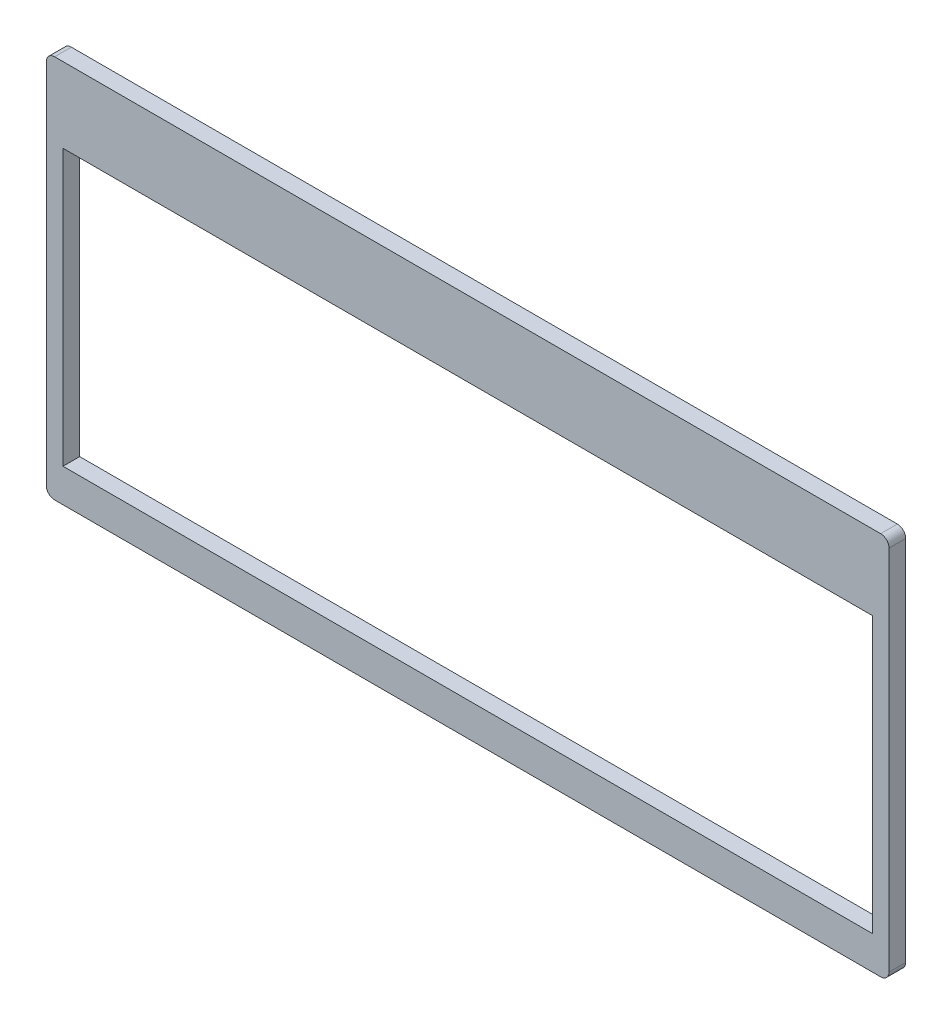
ISO-10303-21;
HEADER;
FILE_DESCRIPTION(('STEP AP214'),'2;1');
FILE_NAME('part.step','',(''),(''),'','','');
FILE_SCHEMA(('AUTOMOTIVE_DESIGN { 1 0 10303 214 1 1 1 1 }'));
ENDSEC;
DATA;
#1=APPLICATION_CONTEXT('core data for automotive mechanical design processes');
#2=APPLICATION_PROTOCOL_DEFINITION('international standard','automotive_design',2000,#1);
#3=PRODUCT_CONTEXT('',#1,'mechanical');
#4=PRODUCT('Part','Part','',(#3));
#5=PRODUCT_RELATED_PRODUCT_CATEGORY('part','',(#4));
#6=PRODUCT_DEFINITION_FORMATION('','',#4);
#7=PRODUCT_DEFINITION_CONTEXT('part definition',#1,'design');
#8=PRODUCT_DEFINITION('design','',#6,#7);
#9=PRODUCT_DEFINITION_SHAPE('','',#8);
#10=(LENGTH_UNIT() NAMED_UNIT(*) SI_UNIT(.MILLI.,.METRE.));
#11=(NAMED_UNIT(*) PLANE_ANGLE_UNIT() SI_UNIT($,.RADIAN.));
#12=(NAMED_UNIT(*) SI_UNIT($,.STERADIAN.) SOLID_ANGLE_UNIT());
#13=UNCERTAINTY_MEASURE_WITH_UNIT(LENGTH_MEASURE(1.E-05),#10,'distance_accuracy_value','');
#14=(GEOMETRIC_REPRESENTATION_CONTEXT(3) GLOBAL_UNCERTAINTY_ASSIGNED_CONTEXT((#13)) GLOBAL_UNIT_ASSIGNED_CONTEXT((#10,
#11,#12)) REPRESENTATION_CONTEXT('',''));
#15=CARTESIAN_POINT('',(0.,0.,0.));
#16=DIRECTION('',(0.,0.,1.));
#17=DIRECTION('',(1.,0.,0.));
#18=AXIS2_PLACEMENT_3D('',#15,#16,#17);
#19=CARTESIAN_POINT('',(0.,0.,2.));
#20=DIRECTION('',(0.,0.,1.));
#21=DIRECTION('',(1.,0.,0.));
#22=AXIS2_PLACEMENT_3D('',#19,#20,#21);
#23=PLANE('',#22);
#24=DIRECTION('',(1.,0.,0.));
#25=VECTOR('',#24,1.);
#26=CARTESIAN_POINT('',(-50.5,-23.,2.));
#27=LINE('',#26,#25);
#28=CARTESIAN_POINT('',(-49.5,-23.,2.));
#29=VERTEX_POINT('',#28);
#30=CARTESIAN_POINT('',(49.5,-23.,2.));
#31=VERTEX_POINT('',#30);
#32=EDGE_CURVE('E173',#29,#31,#27,.T.);
#33=ORIENTED_EDGE('',*,*,#32,.T.);
#34=CARTESIAN_POINT('',(49.5,-22.,2.));
#35=DIRECTION('',(0.,0.,1.));
#36=DIRECTION('',(1.,0.,0.));
#37=AXIS2_PLACEMENT_3D('',#34,#35,#36);
#38=CIRCLE('',#37,1.);
#39=CARTESIAN_POINT('',(50.5,-22.,2.));
#40=VERTEX_POINT('',#39);
#41=EDGE_CURVE('E214',#31,#40,#38,.T.);
#42=ORIENTED_EDGE('',*,*,#41,.T.);
#43=DIRECTION('',(0.,1.,0.));
#44=VECTOR('',#43,1.);
#45=CARTESIAN_POINT('',(50.5,23.,2.));
#46=LINE('',#45,#44);
#47=CARTESIAN_POINT('',(50.5,22.,2.));
#48=VERTEX_POINT('',#47);
#49=EDGE_CURVE('E166',#40,#48,#46,.T.);
#50=ORIENTED_EDGE('',*,*,#49,.T.);
#51=CARTESIAN_POINT('',(49.5,22.,2.));
#52=DIRECTION('',(0.,0.,1.));
#53=DIRECTION('',(1.,0.,0.));
#54=AXIS2_PLACEMENT_3D('',#51,#52,#53);
#55=CIRCLE('',#54,1.);
#56=CARTESIAN_POINT('',(49.5,23.,2.));
#57=VERTEX_POINT('',#56);
#58=EDGE_CURVE('E55',#48,#57,#55,.T.);
#59=ORIENTED_EDGE('',*,*,#58,.T.);
#60=DIRECTION('',(-1.,0.,0.));
#61=VECTOR('',#60,1.);
#62=CARTESIAN_POINT('',(-50.5,23.,2.));
#63=LINE('',#62,#61);
#64=CARTESIAN_POINT('',(-49.5,23.,2.));
#65=VERTEX_POINT('',#64);
#66=EDGE_CURVE('E168',#57,#65,#63,.T.);
#67=ORIENTED_EDGE('',*,*,#66,.T.);
#68=CARTESIAN_POINT('',(-49.5,22.,2.));
#69=DIRECTION('',(0.,0.,1.));
#70=DIRECTION('',(1.,0.,0.));
#71=AXIS2_PLACEMENT_3D('',#68,#69,#70);
#72=CIRCLE('',#71,1.);
#73=CARTESIAN_POINT('',(-50.5,22.,2.));
#74=VERTEX_POINT('',#73);
#75=EDGE_CURVE('E193',#65,#74,#72,.T.);
#76=ORIENTED_EDGE('',*,*,#75,.T.);
#77=DIRECTION('',(0.,-1.,0.));
#78=VECTOR('',#77,1.);
#79=CARTESIAN_POINT('',(-50.5,23.,2.));
#80=LINE('',#79,#78);
#81=CARTESIAN_POINT('',(-50.5,-22.,2.));
#82=VERTEX_POINT('',#81);
#83=EDGE_CURVE('E171',#74,#82,#80,.T.);
#84=ORIENTED_EDGE('',*,*,#83,.T.);
#85=CARTESIAN_POINT('',(-49.5,-22.,2.));
#86=DIRECTION('',(0.,0.,1.));
#87=DIRECTION('',(1.,0.,0.));
#88=AXIS2_PLACEMENT_3D('',#85,#86,#87);
#89=CIRCLE('',#88,1.);
#90=EDGE_CURVE('E211',#82,#29,#89,.T.);
#91=ORIENTED_EDGE('',*,*,#90,.T.);
#92=EDGE_LOOP('',(#33,#42,#50,#59,#67,#76,#84,#91));
#93=FACE_BOUND('',#92,.T.);
#94=DIRECTION('',(-1.,0.,0.));
#95=VECTOR('',#94,1.);
#96=CARTESIAN_POINT('',(-48.5,14.,2.));
#97=LINE('',#96,#95);
#98=CARTESIAN_POINT('',(48.5,14.,2.));
#99=VERTEX_POINT('',#98);
#100=CARTESIAN_POINT('',(-48.5,14.,2.));
#101=VERTEX_POINT('',#100);
#102=EDGE_CURVE('E135',#99,#101,#97,.T.);
#103=ORIENTED_EDGE('',*,*,#102,.F.);
#104=DIRECTION('',(0.,1.,0.));
#105=VECTOR('',#104,1.);
#106=CARTESIAN_POINT('',(48.5,14.,2.));
#107=LINE('',#106,#105);
#108=CARTESIAN_POINT('',(48.5,-19.,2.));
#109=VERTEX_POINT('',#108);
#110=EDGE_CURVE('E125',#109,#99,#107,.T.);
#111=ORIENTED_EDGE('',*,*,#110,.F.);
#112=DIRECTION('',(1.,0.,0.));
#113=VECTOR('',#112,1.);
#114=CARTESIAN_POINT('',(-48.5,-19.,2.));
#115=LINE('',#114,#113);
#116=CARTESIAN_POINT('',(-48.5,-19.,2.));
#117=VERTEX_POINT('',#116);
#118=EDGE_CURVE('E150',#117,#109,#115,.T.);
#119=ORIENTED_EDGE('',*,*,#118,.F.);
#120=DIRECTION('',(0.,-1.,0.));
#121=VECTOR('',#120,1.);
#122=CARTESIAN_POINT('',(-48.5,14.,2.));
#123=LINE('',#122,#121);
#124=EDGE_CURVE('E148',#101,#117,#123,.T.);
#125=ORIENTED_EDGE('',*,*,#124,.F.);
#126=EDGE_LOOP('',(#103,#111,#119,#125));
#127=FACE_BOUND('',#126,.T.);
#128=ADVANCED_FACE('F34',(#93,#127),#23,.T.);
#129=CARTESIAN_POINT('',(0.,0.,0.));
#130=DIRECTION('',(0.,0.,1.));
#131=DIRECTION('',(1.,0.,0.));
#132=AXIS2_PLACEMENT_3D('',#129,#130,#131);
#133=PLANE('',#132);
#134=DIRECTION('',(0.,1.,0.));
#135=VECTOR('',#134,1.);
#136=CARTESIAN_POINT('',(50.5,23.,0.));
#137=LINE('',#136,#135);
#138=CARTESIAN_POINT('',(50.5,-22.,0.));
#139=VERTEX_POINT('',#138);
#140=CARTESIAN_POINT('',(50.5,22.,0.));
#141=VERTEX_POINT('',#140);
#142=EDGE_CURVE('E143',#139,#141,#137,.T.);
#143=ORIENTED_EDGE('',*,*,#142,.F.);
#144=CARTESIAN_POINT('',(49.5,-22.,0.));
#145=DIRECTION('',(0.,0.,1.));
#146=DIRECTION('',(1.,0.,0.));
#147=AXIS2_PLACEMENT_3D('',#144,#145,#146);
#148=CIRCLE('',#147,1.);
#149=CARTESIAN_POINT('',(49.5,-23.,0.));
#150=VERTEX_POINT('',#149);
#151=EDGE_CURVE('E204',#139,#150,#148,.F.);
#152=ORIENTED_EDGE('',*,*,#151,.T.);
#153=DIRECTION('',(1.,0.,0.));
#154=VECTOR('',#153,1.);
#155=CARTESIAN_POINT('',(-50.5,-23.,0.));
#156=LINE('',#155,#154);
#157=CARTESIAN_POINT('',(-49.5,-23.,0.));
#158=VERTEX_POINT('',#157);
#159=EDGE_CURVE('E169',#158,#150,#156,.T.);
#160=ORIENTED_EDGE('',*,*,#159,.F.);
#161=CARTESIAN_POINT('',(-49.5,-22.,0.));
#162=DIRECTION('',(0.,0.,1.));
#163=DIRECTION('',(1.,0.,0.));
#164=AXIS2_PLACEMENT_3D('',#161,#162,#163);
#165=CIRCLE('',#164,1.);
#166=CARTESIAN_POINT('',(-50.5,-22.,0.));
#167=VERTEX_POINT('',#166);
#168=EDGE_CURVE('E200',#158,#167,#165,.F.);
#169=ORIENTED_EDGE('',*,*,#168,.T.);
#170=DIRECTION('',(0.,-1.,0.));
#171=VECTOR('',#170,1.);
#172=CARTESIAN_POINT('',(-50.5,23.,0.));
#173=LINE('',#172,#171);
#174=CARTESIAN_POINT('',(-50.5,22.,0.));
#175=VERTEX_POINT('',#174);
#176=EDGE_CURVE('E181',#175,#167,#173,.T.);
#177=ORIENTED_EDGE('',*,*,#176,.F.);
#178=CARTESIAN_POINT('',(-49.5,22.,0.));
#179=DIRECTION('',(0.,0.,1.));
#180=DIRECTION('',(1.,0.,0.));
#181=AXIS2_PLACEMENT_3D('',#178,#179,#180);
#182=CIRCLE('',#181,1.);
#183=CARTESIAN_POINT('',(-49.5,23.,0.));
#184=VERTEX_POINT('',#183);
#185=EDGE_CURVE('E187',#175,#184,#182,.F.);
#186=ORIENTED_EDGE('',*,*,#185,.T.);
#187=DIRECTION('',(-1.,0.,0.));
#188=VECTOR('',#187,1.);
#189=CARTESIAN_POINT('',(-50.5,23.,0.));
#190=LINE('',#189,#188);
#191=CARTESIAN_POINT('',(49.5,23.,0.));
#192=VERTEX_POINT('',#191);
#193=EDGE_CURVE('E179',#192,#184,#190,.T.);
#194=ORIENTED_EDGE('',*,*,#193,.F.);
#195=CARTESIAN_POINT('',(49.5,22.,0.));
#196=DIRECTION('',(0.,0.,1.));
#197=DIRECTION('',(1.,0.,0.));
#198=AXIS2_PLACEMENT_3D('',#195,#196,#197);
#199=CIRCLE('',#198,1.);
#200=EDGE_CURVE('E202',#192,#141,#199,.F.);
#201=ORIENTED_EDGE('',*,*,#200,.T.);
#202=EDGE_LOOP('',(#143,#152,#160,#169,#177,#186,#194,#201));
#203=FACE_BOUND('',#202,.T.);
#204=DIRECTION('',(0.,1.,0.));
#205=VECTOR('',#204,1.);
#206=CARTESIAN_POINT('',(48.5,14.,0.));
#207=LINE('',#206,#205);
#208=CARTESIAN_POINT('',(48.5,-19.,0.));
#209=VERTEX_POINT('',#208);
#210=CARTESIAN_POINT('',(48.5,14.,0.));
#211=VERTEX_POINT('',#210);
#212=EDGE_CURVE('E154',#209,#211,#207,.T.);
#213=ORIENTED_EDGE('',*,*,#212,.T.);
#214=DIRECTION('',(-1.,0.,0.));
#215=VECTOR('',#214,1.);
#216=CARTESIAN_POINT('',(-48.5,14.,0.));
#217=LINE('',#216,#215);
#218=CARTESIAN_POINT('',(-48.5,14.,0.));
#219=VERTEX_POINT('',#218);
#220=EDGE_CURVE('E142',#211,#219,#217,.T.);
#221=ORIENTED_EDGE('',*,*,#220,.T.);
#222=DIRECTION('',(0.,-1.,0.));
#223=VECTOR('',#222,1.);
#224=CARTESIAN_POINT('',(-48.5,14.,0.));
#225=LINE('',#224,#223);
#226=CARTESIAN_POINT('',(-48.5,-19.,0.));
#227=VERTEX_POINT('',#226);
#228=EDGE_CURVE('E157',#219,#227,#225,.T.);
#229=ORIENTED_EDGE('',*,*,#228,.T.);
#230=DIRECTION('',(1.,0.,0.));
#231=VECTOR('',#230,1.);
#232=CARTESIAN_POINT('',(-48.5,-19.,0.));
#233=LINE('',#232,#231);
#234=EDGE_CURVE('E136',#227,#209,#233,.T.);
#235=ORIENTED_EDGE('',*,*,#234,.T.);
#236=EDGE_LOOP('',(#213,#221,#229,#235));
#237=FACE_BOUND('',#236,.T.);
#238=ADVANCED_FACE('F223',(#203,#237),#133,.F.);
#239=CARTESIAN_POINT('',(50.5,23.,2.));
#240=DIRECTION('',(-1.,0.,0.));
#241=DIRECTION('',(0.,-1.,0.));
#242=AXIS2_PLACEMENT_3D('',#239,#240,#241);
#243=PLANE('',#242);
#244=ORIENTED_EDGE('',*,*,#49,.F.);
#245=DIRECTION('',(0.,0.,-1.));
#246=VECTOR('',#245,1.);
#247=CARTESIAN_POINT('',(50.5,-22.,2.));
#248=LINE('',#247,#246);
#249=EDGE_CURVE('E197',#40,#139,#248,.T.);
#250=ORIENTED_EDGE('',*,*,#249,.T.);
#251=ORIENTED_EDGE('',*,*,#142,.T.);
#252=DIRECTION('',(0.,0.,-1.));
#253=VECTOR('',#252,1.);
#254=CARTESIAN_POINT('',(50.5,22.,2.));
#255=LINE('',#254,#253);
#256=EDGE_CURVE('E195',#141,#48,#255,.F.);
#257=ORIENTED_EDGE('',*,*,#256,.T.);
#258=EDGE_LOOP('',(#244,#250,#251,#257));
#259=FACE_BOUND('',#258,.T.);
#260=ADVANCED_FACE('F246',(#259),#243,.F.);
#261=CARTESIAN_POINT('',(-50.5,23.,2.));
#262=DIRECTION('',(0.,-1.,0.));
#263=DIRECTION('',(0.,0.,-1.));
#264=AXIS2_PLACEMENT_3D('',#261,#262,#263);
#265=PLANE('',#264);
#266=ORIENTED_EDGE('',*,*,#66,.F.);
#267=DIRECTION('',(0.,0.,-1.));
#268=VECTOR('',#267,1.);
#269=CARTESIAN_POINT('',(49.5,23.,2.));
#270=LINE('',#269,#268);
#271=EDGE_CURVE('E42',#57,#192,#270,.T.);
#272=ORIENTED_EDGE('',*,*,#271,.T.);
#273=ORIENTED_EDGE('',*,*,#193,.T.);
#274=DIRECTION('',(0.,0.,-1.));
#275=VECTOR('',#274,1.);
#276=CARTESIAN_POINT('',(-49.5,23.,2.));
#277=LINE('',#276,#275);
#278=EDGE_CURVE('E190',#184,#65,#277,.F.);
#279=ORIENTED_EDGE('',*,*,#278,.T.);
#280=EDGE_LOOP('',(#266,#272,#273,#279));
#281=FACE_BOUND('',#280,.T.);
#282=ADVANCED_FACE('F219',(#281),#265,.F.);
#283=CARTESIAN_POINT('',(-50.5,23.,2.));
#284=DIRECTION('',(1.,0.,0.));
#285=DIRECTION('',(0.,0.,-1.));
#286=AXIS2_PLACEMENT_3D('',#283,#284,#285);
#287=PLANE('',#286);
#288=ORIENTED_EDGE('',*,*,#176,.T.);
#289=DIRECTION('',(0.,0.,-1.));
#290=VECTOR('',#289,1.);
#291=CARTESIAN_POINT('',(-50.5,-22.,2.));
#292=LINE('',#291,#290);
#293=EDGE_CURVE('E11',#167,#82,#292,.F.);
#294=ORIENTED_EDGE('',*,*,#293,.T.);
#295=ORIENTED_EDGE('',*,*,#83,.F.);
#296=DIRECTION('',(0.,0.,-1.));
#297=VECTOR('',#296,1.);
#298=CARTESIAN_POINT('',(-50.5,22.,2.));
#299=LINE('',#298,#297);
#300=EDGE_CURVE('E176',#74,#175,#299,.T.);
#301=ORIENTED_EDGE('',*,*,#300,.T.);
#302=EDGE_LOOP('',(#288,#294,#295,#301));
#303=FACE_BOUND('',#302,.T.);
#304=ADVANCED_FACE('F232',(#303),#287,.F.);
#305=CARTESIAN_POINT('',(-50.5,-23.,2.));
#306=DIRECTION('',(0.,1.,0.));
#307=DIRECTION('',(0.,0.,1.));
#308=AXIS2_PLACEMENT_3D('',#305,#306,#307);
#309=PLANE('',#308);
#310=ORIENTED_EDGE('',*,*,#159,.T.);
#311=DIRECTION('',(0.,0.,-1.));
#312=VECTOR('',#311,1.);
#313=CARTESIAN_POINT('',(49.5,-23.,2.));
#314=LINE('',#313,#312);
#315=EDGE_CURVE('E209',#150,#31,#314,.F.);
#316=ORIENTED_EDGE('',*,*,#315,.T.);
#317=ORIENTED_EDGE('',*,*,#32,.F.);
#318=DIRECTION('',(0.,0.,-1.));
#319=VECTOR('',#318,1.);
#320=CARTESIAN_POINT('',(-49.5,-23.,2.));
#321=LINE('',#320,#319);
#322=EDGE_CURVE('E206',#29,#158,#321,.T.);
#323=ORIENTED_EDGE('',*,*,#322,.T.);
#324=EDGE_LOOP('',(#310,#316,#317,#323));
#325=FACE_BOUND('',#324,.T.);
#326=ADVANCED_FACE('F238',(#325),#309,.F.);
#327=CARTESIAN_POINT('',(48.5,14.,2.));
#328=DIRECTION('',(-1.,0.,0.));
#329=DIRECTION('',(0.,0.,1.));
#330=AXIS2_PLACEMENT_3D('',#327,#328,#329);
#331=PLANE('',#330);
#332=ORIENTED_EDGE('',*,*,#212,.F.);
#333=DIRECTION('',(0.,0.,-1.));
#334=VECTOR('',#333,1.);
#335=CARTESIAN_POINT('',(48.5,-19.,2.));
#336=LINE('',#335,#334);
#337=EDGE_CURVE('E131',#109,#209,#336,.T.);
#338=ORIENTED_EDGE('',*,*,#337,.F.);
#339=ORIENTED_EDGE('',*,*,#110,.T.);
#340=DIRECTION('',(0.,0.,-1.));
#341=VECTOR('',#340,1.);
#342=CARTESIAN_POINT('',(48.5,14.,2.));
#343=LINE('',#342,#341);
#344=EDGE_CURVE('E128',#99,#211,#343,.T.);
#345=ORIENTED_EDGE('',*,*,#344,.T.);
#346=EDGE_LOOP('',(#332,#338,#339,#345));
#347=FACE_BOUND('',#346,.T.);
#348=ADVANCED_FACE('F127',(#347),#331,.T.);
#349=CARTESIAN_POINT('',(-48.5,14.,2.));
#350=DIRECTION('',(0.,-1.,0.));
#351=DIRECTION('',(0.,0.,-1.));
#352=AXIS2_PLACEMENT_3D('',#349,#350,#351);
#353=PLANE('',#352);
#354=ORIENTED_EDGE('',*,*,#220,.F.);
#355=ORIENTED_EDGE('',*,*,#344,.F.);
#356=ORIENTED_EDGE('',*,*,#102,.T.);
#357=DIRECTION('',(0.,0.,-1.));
#358=VECTOR('',#357,1.);
#359=CARTESIAN_POINT('',(-48.5,14.,2.));
#360=LINE('',#359,#358);
#361=EDGE_CURVE('E144',#101,#219,#360,.T.);
#362=ORIENTED_EDGE('',*,*,#361,.T.);
#363=EDGE_LOOP('',(#354,#355,#356,#362));
#364=FACE_BOUND('',#363,.T.);
#365=ADVANCED_FACE('F139',(#364),#353,.T.);
#366=CARTESIAN_POINT('',(-48.5,14.,2.));
#367=DIRECTION('',(1.,0.,0.));
#368=DIRECTION('',(0.,1.,0.));
#369=AXIS2_PLACEMENT_3D('',#366,#367,#368);
#370=PLANE('',#369);
#371=ORIENTED_EDGE('',*,*,#228,.F.);
#372=ORIENTED_EDGE('',*,*,#361,.F.);
#373=ORIENTED_EDGE('',*,*,#124,.T.);
#374=DIRECTION('',(0.,0.,-1.));
#375=VECTOR('',#374,1.);
#376=CARTESIAN_POINT('',(-48.5,-19.,2.));
#377=LINE('',#376,#375);
#378=EDGE_CURVE('E163',#117,#227,#377,.T.);
#379=ORIENTED_EDGE('',*,*,#378,.T.);
#380=EDGE_LOOP('',(#371,#372,#373,#379));
#381=FACE_BOUND('',#380,.T.);
#382=ADVANCED_FACE('F277',(#381),#370,.T.);
#383=CARTESIAN_POINT('',(-48.5,-19.,2.));
#384=DIRECTION('',(0.,1.,0.));
#385=DIRECTION('',(0.,0.,1.));
#386=AXIS2_PLACEMENT_3D('',#383,#384,#385);
#387=PLANE('',#386);
#388=ORIENTED_EDGE('',*,*,#234,.F.);
#389=ORIENTED_EDGE('',*,*,#378,.F.);
#390=ORIENTED_EDGE('',*,*,#118,.T.);
#391=ORIENTED_EDGE('',*,*,#337,.T.);
#392=EDGE_LOOP('',(#388,#389,#390,#391));
#393=FACE_BOUND('',#392,.T.);
#394=ADVANCED_FACE('F273',(#393),#387,.T.);
#395=CARTESIAN_POINT('',(-49.5,22.,2.));
#396=DIRECTION('',(0.,0.,-1.));
#397=DIRECTION('',(-1.,0.,0.));
#398=AXIS2_PLACEMENT_3D('',#395,#396,#397);
#399=CYLINDRICAL_SURFACE('',#398,1.);
#400=ORIENTED_EDGE('',*,*,#75,.F.);
#401=ORIENTED_EDGE('',*,*,#278,.F.);
#402=ORIENTED_EDGE('',*,*,#185,.F.);
#403=ORIENTED_EDGE('',*,*,#300,.F.);
#404=EDGE_LOOP('',(#400,#401,#402,#403));
#405=FACE_BOUND('',#404,.T.);
#406=ADVANCED_FACE('F230',(#405),#399,.T.);
#407=CARTESIAN_POINT('',(49.5,-22.,2.));
#408=DIRECTION('',(0.,0.,-1.));
#409=DIRECTION('',(-1.,0.,0.));
#410=AXIS2_PLACEMENT_3D('',#407,#408,#409);
#411=CYLINDRICAL_SURFACE('',#410,1.);
#412=ORIENTED_EDGE('',*,*,#41,.F.);
#413=ORIENTED_EDGE('',*,*,#315,.F.);
#414=ORIENTED_EDGE('',*,*,#151,.F.);
#415=ORIENTED_EDGE('',*,*,#249,.F.);
#416=EDGE_LOOP('',(#412,#413,#414,#415));
#417=FACE_BOUND('',#416,.T.);
#418=ADVANCED_FACE('F242',(#417),#411,.T.);
#419=CARTESIAN_POINT('',(49.5,22.,2.));
#420=DIRECTION('',(0.,0.,-1.));
#421=DIRECTION('',(-1.,0.,0.));
#422=AXIS2_PLACEMENT_3D('',#419,#420,#421);
#423=CYLINDRICAL_SURFACE('',#422,1.);
#424=ORIENTED_EDGE('',*,*,#58,.F.);
#425=ORIENTED_EDGE('',*,*,#256,.F.);
#426=ORIENTED_EDGE('',*,*,#200,.F.);
#427=ORIENTED_EDGE('',*,*,#271,.F.);
#428=EDGE_LOOP('',(#424,#425,#426,#427));
#429=FACE_BOUND('',#428,.T.);
#430=ADVANCED_FACE('F248',(#429),#423,.T.);
#431=CARTESIAN_POINT('',(-49.5,-22.,2.));
#432=DIRECTION('',(0.,0.,-1.));
#433=DIRECTION('',(-1.,0.,0.));
#434=AXIS2_PLACEMENT_3D('',#431,#432,#433);
#435=CYLINDRICAL_SURFACE('',#434,1.);
#436=ORIENTED_EDGE('',*,*,#90,.F.);
#437=ORIENTED_EDGE('',*,*,#293,.F.);
#438=ORIENTED_EDGE('',*,*,#168,.F.);
#439=ORIENTED_EDGE('',*,*,#322,.F.);
#440=EDGE_LOOP('',(#436,#437,#438,#439));
#441=FACE_BOUND('',#440,.T.);
#442=ADVANCED_FACE('F36',(#441),#435,.T.);
#443=CLOSED_SHELL('',(#128,#238,#260,#282,#304,#326,#348,#365,#382,#394,#406,#418,#430,#442));
#444=MANIFOLD_SOLID_BREP('B2',#443);
#445=ADVANCED_BREP_SHAPE_REPRESENTATION('',(#18,#444),#14);
#446=SHAPE_DEFINITION_REPRESENTATION(#9,#445);
ENDSEC;
END-ISO-10303-21;
